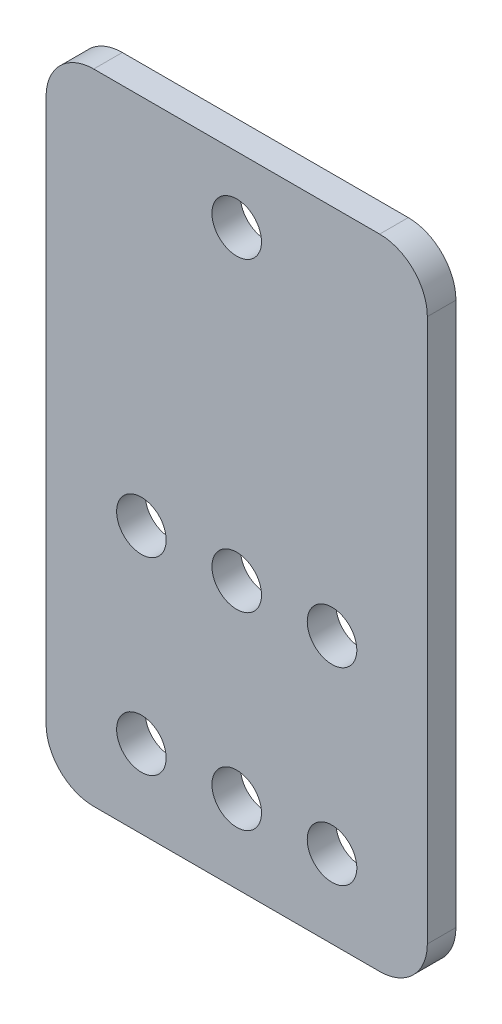
ISO-10303-21;
HEADER;
FILE_DESCRIPTION(('STEP AP214'),'2;1');
FILE_NAME('part.step','',(''),(''),'','','');
FILE_SCHEMA(('AUTOMOTIVE_DESIGN { 1 0 10303 214 1 1 1 1 }'));
ENDSEC;
DATA;
#1=APPLICATION_CONTEXT('core data for automotive mechanical design processes');
#2=APPLICATION_PROTOCOL_DEFINITION('international standard','automotive_design',2000,#1);
#3=PRODUCT_CONTEXT('',#1,'mechanical');
#4=PRODUCT('Part','Part','',(#3));
#5=PRODUCT_RELATED_PRODUCT_CATEGORY('part','',(#4));
#6=PRODUCT_DEFINITION_FORMATION('','',#4);
#7=PRODUCT_DEFINITION_CONTEXT('part definition',#1,'design');
#8=PRODUCT_DEFINITION('design','',#6,#7);
#9=PRODUCT_DEFINITION_SHAPE('','',#8);
#10=(LENGTH_UNIT() NAMED_UNIT(*) SI_UNIT(.MILLI.,.METRE.));
#11=(NAMED_UNIT(*) PLANE_ANGLE_UNIT() SI_UNIT($,.RADIAN.));
#12=(NAMED_UNIT(*) SI_UNIT($,.STERADIAN.) SOLID_ANGLE_UNIT());
#13=UNCERTAINTY_MEASURE_WITH_UNIT(LENGTH_MEASURE(1.E-05),#10,'distance_accuracy_value','');
#14=(GEOMETRIC_REPRESENTATION_CONTEXT(3) GLOBAL_UNCERTAINTY_ASSIGNED_CONTEXT((#13)) GLOBAL_UNIT_ASSIGNED_CONTEXT((#10,
#11,#12)) REPRESENTATION_CONTEXT('',''));
#15=CARTESIAN_POINT('',(0.,0.,0.));
#16=DIRECTION('',(0.,0.,1.));
#17=DIRECTION('',(1.,0.,0.));
#18=AXIS2_PLACEMENT_3D('',#15,#16,#17);
#19=CARTESIAN_POINT('',(-2.09664305646129,3.50955153260209,0.0876618779343517));
#20=DIRECTION('',(0.,0.,1.));
#21=DIRECTION('',(1.,0.,0.));
#22=AXIS2_PLACEMENT_3D('',#19,#20,#21);
#23=PLANE('',#22);
#24=CARTESIAN_POINT('',(-2.09664305646135,-1.99044846739791,0.0876618779343517));
#25=DIRECTION('',(0.,0.,1.));
#26=DIRECTION('',(1.,0.,0.));
#27=AXIS2_PLACEMENT_3D('',#24,#25,#26);
#28=CIRCLE('',#27,2.6);
#29=CARTESIAN_POINT('',(0.503356943538655,-1.99044846739791,0.0876618779343517));
#30=VERTEX_POINT('',#29);
#31=EDGE_CURVE('E189',#30,#30,#28,.T.);
#32=ORIENTED_EDGE('',*,*,#31,.F.);
#33=EDGE_LOOP('',(#32));
#34=FACE_BOUND('',#33,.T.);
#35=CARTESIAN_POINT('',(7.9033569435388,-21.7904484673979,0.0876618779343517));
#36=DIRECTION('',(0.,0.,1.));
#37=DIRECTION('',(-1.,0.,0.));
#38=AXIS2_PLACEMENT_3D('',#35,#36,#37);
#39=CIRCLE('',#38,2.59999999999999);
#40=CARTESIAN_POINT('',(5.30335694353881,-21.7904484673979,0.0876618779343517));
#41=VERTEX_POINT('',#40);
#42=EDGE_CURVE('E177',#41,#41,#39,.T.);
#43=ORIENTED_EDGE('',*,*,#42,.F.);
#44=EDGE_LOOP('',(#43));
#45=FACE_BOUND('',#44,.T.);
#46=CARTESIAN_POINT('',(-12.0966430564612,-21.7904484673979,0.0876618779343517));
#47=DIRECTION('',(0.,0.,1.));
#48=DIRECTION('',(1.,0.,0.));
#49=AXIS2_PLACEMENT_3D('',#46,#47,#48);
#50=CIRCLE('',#49,2.59999999999999);
#51=CARTESIAN_POINT('',(-9.49664305646121,-21.7904484673979,0.0876618779343517));
#52=VERTEX_POINT('',#51);
#53=EDGE_CURVE('E166',#52,#52,#50,.T.);
#54=ORIENTED_EDGE('',*,*,#53,.F.);
#55=EDGE_LOOP('',(#54));
#56=FACE_BOUND('',#55,.T.);
#57=DIRECTION('',(1.,0.,0.));
#58=VECTOR('',#57,1.);
#59=CARTESIAN_POINT('',(17.9033569435387,-29.990448467398,0.0876618779343517));
#60=LINE('',#59,#58);
#61=CARTESIAN_POINT('',(-17.0966430564613,-29.990448467398,0.0876618779343517));
#62=VERTEX_POINT('',#61);
#63=CARTESIAN_POINT('',(12.9033569435387,-29.990448467398,0.0876618779343517));
#64=VERTEX_POINT('',#63);
#65=EDGE_CURVE('E152',#62,#64,#60,.T.);
#66=ORIENTED_EDGE('',*,*,#65,.T.);
#67=CARTESIAN_POINT('',(12.9033569435387,-24.990448467398,0.0876618779343517));
#68=DIRECTION('',(0.,0.,1.));
#69=DIRECTION('',(1.,0.,0.));
#70=AXIS2_PLACEMENT_3D('',#67,#68,#69);
#71=CIRCLE('',#70,5.);
#72=CARTESIAN_POINT('',(17.9033569435387,-24.990448467398,0.0876618779343517));
#73=VERTEX_POINT('',#72);
#74=EDGE_CURVE('E130',#64,#73,#71,.T.);
#75=ORIENTED_EDGE('',*,*,#74,.T.);
#76=DIRECTION('',(0.,1.,0.));
#77=VECTOR('',#76,1.);
#78=CARTESIAN_POINT('',(17.9033569435387,-29.990448467398,0.0876618779343517));
#79=LINE('',#78,#77);
#80=CARTESIAN_POINT('',(17.9033569435387,32.009551532602,0.0876618779343517));
#81=VERTEX_POINT('',#80);
#82=EDGE_CURVE('E100',#73,#81,#79,.T.);
#83=ORIENTED_EDGE('',*,*,#82,.T.);
#84=CARTESIAN_POINT('',(12.9033569435387,32.009551532602,0.0876618779343517));
#85=DIRECTION('',(0.,0.,1.));
#86=DIRECTION('',(1.,0.,0.));
#87=AXIS2_PLACEMENT_3D('',#84,#85,#86);
#88=CIRCLE('',#87,5.);
#89=CARTESIAN_POINT('',(12.9033569435387,37.009551532602,0.0876618779343517));
#90=VERTEX_POINT('',#89);
#91=EDGE_CURVE('E36',#81,#90,#88,.T.);
#92=ORIENTED_EDGE('',*,*,#91,.T.);
#93=DIRECTION('',(-1.,0.,0.));
#94=VECTOR('',#93,1.);
#95=CARTESIAN_POINT('',(17.9033569435387,37.009551532602,0.0876618779343517));
#96=LINE('',#95,#94);
#97=CARTESIAN_POINT('',(-17.0966430564613,37.009551532602,0.0876618779343517));
#98=VERTEX_POINT('',#97);
#99=EDGE_CURVE('E116',#90,#98,#96,.T.);
#100=ORIENTED_EDGE('',*,*,#99,.T.);
#101=CARTESIAN_POINT('',(-17.0966430564613,32.009551532602,0.0876618779343517));
#102=DIRECTION('',(0.,0.,1.));
#103=DIRECTION('',(1.,0.,0.));
#104=AXIS2_PLACEMENT_3D('',#101,#102,#103);
#105=CIRCLE('',#104,5.);
#106=CARTESIAN_POINT('',(-22.0966430564613,32.009551532602,0.0876618779343517));
#107=VERTEX_POINT('',#106);
#108=EDGE_CURVE('E126',#98,#107,#105,.T.);
#109=ORIENTED_EDGE('',*,*,#108,.T.);
#110=DIRECTION('',(0.,-1.,0.));
#111=VECTOR('',#110,1.);
#112=CARTESIAN_POINT('',(-22.0966430564613,-29.990448467398,0.0876618779343517));
#113=LINE('',#112,#111);
#114=CARTESIAN_POINT('',(-22.0966430564613,-24.990448467398,0.0876618779343517));
#115=VERTEX_POINT('',#114);
#116=EDGE_CURVE('E110',#107,#115,#113,.T.);
#117=ORIENTED_EDGE('',*,*,#116,.T.);
#118=CARTESIAN_POINT('',(-17.0966430564613,-24.990448467398,0.0876618779343517));
#119=DIRECTION('',(0.,0.,1.));
#120=DIRECTION('',(1.,0.,0.));
#121=AXIS2_PLACEMENT_3D('',#118,#119,#120);
#122=CIRCLE('',#121,5.);
#123=EDGE_CURVE('E128',#115,#62,#122,.T.);
#124=ORIENTED_EDGE('',*,*,#123,.T.);
#125=EDGE_LOOP('',(#66,#75,#83,#92,#100,#109,#117,#124));
#126=FACE_BOUND('',#125,.T.);
#127=CARTESIAN_POINT('',(-2.09664305646129,30.109551532602,0.0876618779343517));
#128=DIRECTION('',(0.,0.,1.));
#129=DIRECTION('',(1.,0.,0.));
#130=AXIS2_PLACEMENT_3D('',#127,#128,#129);
#131=CIRCLE('',#130,2.6);
#132=CARTESIAN_POINT('',(0.503356943538712,30.109551532602,0.0876618779343517));
#133=VERTEX_POINT('',#132);
#134=EDGE_CURVE('E161',#133,#133,#131,.T.);
#135=ORIENTED_EDGE('',*,*,#134,.F.);
#136=EDGE_LOOP('',(#135));
#137=FACE_BOUND('',#136,.T.);
#138=CARTESIAN_POINT('',(-2.0966430564612,-21.7904484673979,0.0876618779343517));
#139=DIRECTION('',(0.,0.,1.));
#140=DIRECTION('',(1.,0.,0.));
#141=AXIS2_PLACEMENT_3D('',#138,#139,#140);
#142=CIRCLE('',#141,2.59999999999999);
#143=CARTESIAN_POINT('',(0.50335694353879,-21.7904484673979,0.0876618779343517));
#144=VERTEX_POINT('',#143);
#145=EDGE_CURVE('E171',#144,#144,#142,.T.);
#146=ORIENTED_EDGE('',*,*,#145,.F.);
#147=EDGE_LOOP('',(#146));
#148=FACE_BOUND('',#147,.T.);
#149=CARTESIAN_POINT('',(-12.0966430564613,-1.99044846739791,0.0876618779343517));
#150=DIRECTION('',(0.,0.,1.));
#151=DIRECTION('',(1.,0.,0.));
#152=AXIS2_PLACEMENT_3D('',#149,#150,#151);
#153=CIRCLE('',#152,2.6);
#154=CARTESIAN_POINT('',(-9.49664305646127,-1.99044846739791,0.0876618779343517));
#155=VERTEX_POINT('',#154);
#156=EDGE_CURVE('E183',#155,#155,#153,.T.);
#157=ORIENTED_EDGE('',*,*,#156,.F.);
#158=EDGE_LOOP('',(#157));
#159=FACE_BOUND('',#158,.T.);
#160=CARTESIAN_POINT('',(7.90335694353873,-1.99044846739785,0.0876618779343517));
#161=DIRECTION('',(0.,0.,1.));
#162=DIRECTION('',(-1.,0.,0.));
#163=AXIS2_PLACEMENT_3D('',#160,#161,#162);
#164=CIRCLE('',#163,2.59999999999999);
#165=CARTESIAN_POINT('',(5.30335694353874,-1.99044846739785,0.0876618779343517));
#166=VERTEX_POINT('',#165);
#167=EDGE_CURVE('E195',#166,#166,#164,.T.);
#168=ORIENTED_EDGE('',*,*,#167,.F.);
#169=EDGE_LOOP('',(#168));
#170=FACE_BOUND('',#169,.T.);
#171=ADVANCED_FACE('F16',(#34,#45,#56,#126,#137,#148,#159,#170),#23,.T.);
#172=CARTESIAN_POINT('',(-2.09664305646129,3.50955153260209,-2.91233812206565));
#173=DIRECTION('',(0.,0.,1.));
#174=DIRECTION('',(1.,0.,0.));
#175=AXIS2_PLACEMENT_3D('',#172,#173,#174);
#176=PLANE('',#175);
#177=DIRECTION('',(0.,1.,0.));
#178=VECTOR('',#177,1.);
#179=CARTESIAN_POINT('',(17.9033569435387,-29.990448467398,-2.91233812206565));
#180=LINE('',#179,#178);
#181=CARTESIAN_POINT('',(17.9033569435387,-24.990448467398,-2.91233812206565));
#182=VERTEX_POINT('',#181);
#183=CARTESIAN_POINT('',(17.9033569435387,32.009551532602,-2.91233812206565));
#184=VERTEX_POINT('',#183);
#185=EDGE_CURVE('E98',#182,#184,#180,.T.);
#186=ORIENTED_EDGE('',*,*,#185,.F.);
#187=CARTESIAN_POINT('',(12.9033569435387,-24.990448467398,-2.91233812206565));
#188=DIRECTION('',(0.,0.,1.));
#189=DIRECTION('',(1.,0.,0.));
#190=AXIS2_PLACEMENT_3D('',#187,#188,#189);
#191=CIRCLE('',#190,5.);
#192=CARTESIAN_POINT('',(12.9033569435387,-29.990448467398,-2.91233812206565));
#193=VERTEX_POINT('',#192);
#194=EDGE_CURVE('E81',#182,#193,#191,.F.);
#195=ORIENTED_EDGE('',*,*,#194,.T.);
#196=DIRECTION('',(1.,0.,0.));
#197=VECTOR('',#196,1.);
#198=CARTESIAN_POINT('',(17.9033569435387,-29.990448467398,-2.91233812206565));
#199=LINE('',#198,#197);
#200=CARTESIAN_POINT('',(-17.0966430564613,-29.990448467398,-2.91233812206565));
#201=VERTEX_POINT('',#200);
#202=EDGE_CURVE('E108',#201,#193,#199,.T.);
#203=ORIENTED_EDGE('',*,*,#202,.F.);
#204=CARTESIAN_POINT('',(-17.0966430564613,-24.990448467398,-2.91233812206565));
#205=DIRECTION('',(0.,0.,1.));
#206=DIRECTION('',(1.,0.,0.));
#207=AXIS2_PLACEMENT_3D('',#204,#205,#206);
#208=CIRCLE('',#207,5.);
#209=CARTESIAN_POINT('',(-22.0966430564613,-24.990448467398,-2.91233812206565));
#210=VERTEX_POINT('',#209);
#211=EDGE_CURVE('E92',#201,#210,#208,.F.);
#212=ORIENTED_EDGE('',*,*,#211,.T.);
#213=DIRECTION('',(0.,-1.,0.));
#214=VECTOR('',#213,1.);
#215=CARTESIAN_POINT('',(-22.0966430564613,-29.990448467398,-2.91233812206565));
#216=LINE('',#215,#214);
#217=CARTESIAN_POINT('',(-22.0966430564613,32.009551532602,-2.91233812206565));
#218=VERTEX_POINT('',#217);
#219=EDGE_CURVE('E112',#218,#210,#216,.T.);
#220=ORIENTED_EDGE('',*,*,#219,.F.);
#221=CARTESIAN_POINT('',(-17.0966430564613,32.009551532602,-2.91233812206565));
#222=DIRECTION('',(0.,0.,1.));
#223=DIRECTION('',(1.,0.,0.));
#224=AXIS2_PLACEMENT_3D('',#221,#222,#223);
#225=CIRCLE('',#224,5.);
#226=CARTESIAN_POINT('',(-17.0966430564613,37.009551532602,-2.91233812206565));
#227=VERTEX_POINT('',#226);
#228=EDGE_CURVE('E119',#218,#227,#225,.F.);
#229=ORIENTED_EDGE('',*,*,#228,.T.);
#230=DIRECTION('',(-1.,0.,0.));
#231=VECTOR('',#230,1.);
#232=CARTESIAN_POINT('',(17.9033569435387,37.009551532602,-2.91233812206565));
#233=LINE('',#232,#231);
#234=CARTESIAN_POINT('',(12.9033569435387,37.009551532602,-2.91233812206565));
#235=VERTEX_POINT('',#234);
#236=EDGE_CURVE('E107',#235,#227,#233,.T.);
#237=ORIENTED_EDGE('',*,*,#236,.F.);
#238=CARTESIAN_POINT('',(12.9033569435387,32.009551532602,-2.91233812206565));
#239=DIRECTION('',(0.,0.,1.));
#240=DIRECTION('',(1.,0.,0.));
#241=AXIS2_PLACEMENT_3D('',#238,#239,#240);
#242=CIRCLE('',#241,5.);
#243=EDGE_CURVE('E101',#235,#184,#242,.F.);
#244=ORIENTED_EDGE('',*,*,#243,.T.);
#245=EDGE_LOOP('',(#186,#195,#203,#212,#220,#229,#237,#244));
#246=FACE_BOUND('',#245,.T.);
#247=CARTESIAN_POINT('',(-2.09664305646129,30.109551532602,-2.91233812206565));
#248=DIRECTION('',(0.,0.,1.));
#249=DIRECTION('',(1.,0.,0.));
#250=AXIS2_PLACEMENT_3D('',#247,#248,#249);
#251=CIRCLE('',#250,2.6);
#252=CARTESIAN_POINT('',(0.503356943538712,30.109551532602,-2.91233812206565));
#253=VERTEX_POINT('',#252);
#254=EDGE_CURVE('E157',#253,#253,#251,.T.);
#255=ORIENTED_EDGE('',*,*,#254,.T.);
#256=EDGE_LOOP('',(#255));
#257=FACE_BOUND('',#256,.T.);
#258=CARTESIAN_POINT('',(-12.0966430564612,-21.7904484673979,-2.91233812206565));
#259=DIRECTION('',(0.,0.,1.));
#260=DIRECTION('',(1.,0.,0.));
#261=AXIS2_PLACEMENT_3D('',#258,#259,#260);
#262=CIRCLE('',#261,2.59999999999999);
#263=CARTESIAN_POINT('',(-9.49664305646121,-21.7904484673979,-2.91233812206565));
#264=VERTEX_POINT('',#263);
#265=EDGE_CURVE('E168',#264,#264,#262,.T.);
#266=ORIENTED_EDGE('',*,*,#265,.T.);
#267=EDGE_LOOP('',(#266));
#268=FACE_BOUND('',#267,.T.);
#269=CARTESIAN_POINT('',(-2.0966430564612,-21.7904484673979,-2.91233812206565));
#270=DIRECTION('',(0.,0.,1.));
#271=DIRECTION('',(1.,0.,0.));
#272=AXIS2_PLACEMENT_3D('',#269,#270,#271);
#273=CIRCLE('',#272,2.59999999999999);
#274=CARTESIAN_POINT('',(0.50335694353879,-21.7904484673979,-2.91233812206565));
#275=VERTEX_POINT('',#274);
#276=EDGE_CURVE('E174',#275,#275,#273,.T.);
#277=ORIENTED_EDGE('',*,*,#276,.T.);
#278=EDGE_LOOP('',(#277));
#279=FACE_BOUND('',#278,.T.);
#280=CARTESIAN_POINT('',(7.9033569435388,-21.7904484673979,-2.91233812206565));
#281=DIRECTION('',(0.,0.,1.));
#282=DIRECTION('',(-1.,0.,0.));
#283=AXIS2_PLACEMENT_3D('',#280,#281,#282);
#284=CIRCLE('',#283,2.59999999999999);
#285=CARTESIAN_POINT('',(5.30335694353881,-21.7904484673979,-2.91233812206565));
#286=VERTEX_POINT('',#285);
#287=EDGE_CURVE('E180',#286,#286,#284,.T.);
#288=ORIENTED_EDGE('',*,*,#287,.T.);
#289=EDGE_LOOP('',(#288));
#290=FACE_BOUND('',#289,.T.);
#291=CARTESIAN_POINT('',(-12.0966430564613,-1.99044846739791,-2.91233812206565));
#292=DIRECTION('',(0.,0.,1.));
#293=DIRECTION('',(1.,0.,0.));
#294=AXIS2_PLACEMENT_3D('',#291,#292,#293);
#295=CIRCLE('',#294,2.6);
#296=CARTESIAN_POINT('',(-9.49664305646127,-1.99044846739791,-2.91233812206565));
#297=VERTEX_POINT('',#296);
#298=EDGE_CURVE('E186',#297,#297,#295,.T.);
#299=ORIENTED_EDGE('',*,*,#298,.T.);
#300=EDGE_LOOP('',(#299));
#301=FACE_BOUND('',#300,.T.);
#302=CARTESIAN_POINT('',(-2.09664305646135,-1.99044846739791,-2.91233812206565));
#303=DIRECTION('',(0.,0.,1.));
#304=DIRECTION('',(1.,0.,0.));
#305=AXIS2_PLACEMENT_3D('',#302,#303,#304);
#306=CIRCLE('',#305,2.6);
#307=CARTESIAN_POINT('',(0.503356943538655,-1.99044846739791,-2.91233812206565));
#308=VERTEX_POINT('',#307);
#309=EDGE_CURVE('E192',#308,#308,#306,.T.);
#310=ORIENTED_EDGE('',*,*,#309,.T.);
#311=EDGE_LOOP('',(#310));
#312=FACE_BOUND('',#311,.T.);
#313=CARTESIAN_POINT('',(7.90335694353873,-1.99044846739785,-2.91233812206565));
#314=DIRECTION('',(0.,0.,1.));
#315=DIRECTION('',(-1.,0.,0.));
#316=AXIS2_PLACEMENT_3D('',#313,#314,#315);
#317=CIRCLE('',#316,2.59999999999999);
#318=CARTESIAN_POINT('',(5.30335694353874,-1.99044846739785,-2.91233812206565));
#319=VERTEX_POINT('',#318);
#320=EDGE_CURVE('E198',#319,#319,#317,.T.);
#321=ORIENTED_EDGE('',*,*,#320,.T.);
#322=EDGE_LOOP('',(#321));
#323=FACE_BOUND('',#322,.T.);
#324=ADVANCED_FACE('F104',(#246,#257,#268,#279,#290,#301,#312,#323),#176,.F.);
#325=CARTESIAN_POINT('',(-22.0966430564613,-29.990448467398,0.0876618779343517));
#326=DIRECTION('',(1.,0.,0.));
#327=DIRECTION('',(0.,1.,0.));
#328=AXIS2_PLACEMENT_3D('',#325,#326,#327);
#329=PLANE('',#328);
#330=ORIENTED_EDGE('',*,*,#219,.T.);
#331=DIRECTION('',(0.,0.,-1.));
#332=VECTOR('',#331,1.);
#333=CARTESIAN_POINT('',(-22.0966430564613,-24.990448467398,0.0876618779343517));
#334=LINE('',#333,#332);
#335=EDGE_CURVE('E135',#210,#115,#334,.F.);
#336=ORIENTED_EDGE('',*,*,#335,.T.);
#337=ORIENTED_EDGE('',*,*,#116,.F.);
#338=DIRECTION('',(0.,0.,-1.));
#339=VECTOR('',#338,1.);
#340=CARTESIAN_POINT('',(-22.0966430564613,32.009551532602,0.0876618779343517));
#341=LINE('',#340,#339);
#342=EDGE_CURVE('E132',#107,#218,#341,.T.);
#343=ORIENTED_EDGE('',*,*,#342,.T.);
#344=EDGE_LOOP('',(#330,#336,#337,#343));
#345=FACE_BOUND('',#344,.T.);
#346=ADVANCED_FACE('F148',(#345),#329,.F.);
#347=CARTESIAN_POINT('',(17.9033569435387,-29.990448467398,0.0876618779343517));
#348=DIRECTION('',(0.,1.,0.));
#349=DIRECTION('',(-1.,0.,0.));
#350=AXIS2_PLACEMENT_3D('',#347,#348,#349);
#351=PLANE('',#350);
#352=ORIENTED_EDGE('',*,*,#202,.T.);
#353=DIRECTION('',(0.,0.,-1.));
#354=VECTOR('',#353,1.);
#355=CARTESIAN_POINT('',(12.9033569435387,-29.990448467398,0.0876618779343517));
#356=LINE('',#355,#354);
#357=EDGE_CURVE('E86',#193,#64,#356,.F.);
#358=ORIENTED_EDGE('',*,*,#357,.T.);
#359=ORIENTED_EDGE('',*,*,#65,.F.);
#360=DIRECTION('',(0.,0.,-1.));
#361=VECTOR('',#360,1.);
#362=CARTESIAN_POINT('',(-17.0966430564613,-29.990448467398,0.0876618779343517));
#363=LINE('',#362,#361);
#364=EDGE_CURVE('E91',#62,#201,#363,.T.);
#365=ORIENTED_EDGE('',*,*,#364,.T.);
#366=EDGE_LOOP('',(#352,#358,#359,#365));
#367=FACE_BOUND('',#366,.T.);
#368=ADVANCED_FACE('F225',(#367),#351,.F.);
#369=CARTESIAN_POINT('',(17.9033569435387,-29.990448467398,0.0876618779343517));
#370=DIRECTION('',(-1.,0.,0.));
#371=DIRECTION('',(0.,-1.,0.));
#372=AXIS2_PLACEMENT_3D('',#369,#370,#371);
#373=PLANE('',#372);
#374=ORIENTED_EDGE('',*,*,#82,.F.);
#375=DIRECTION('',(0.,0.,-1.));
#376=VECTOR('',#375,1.);
#377=CARTESIAN_POINT('',(17.9033569435387,-24.990448467398,0.0876618779343517));
#378=LINE('',#377,#376);
#379=EDGE_CURVE('E85',#73,#182,#378,.T.);
#380=ORIENTED_EDGE('',*,*,#379,.T.);
#381=ORIENTED_EDGE('',*,*,#185,.T.);
#382=DIRECTION('',(0.,0.,-1.));
#383=VECTOR('',#382,1.);
#384=CARTESIAN_POINT('',(17.9033569435387,32.009551532602,0.0876618779343517));
#385=LINE('',#384,#383);
#386=EDGE_CURVE('E102',#184,#81,#385,.F.);
#387=ORIENTED_EDGE('',*,*,#386,.T.);
#388=EDGE_LOOP('',(#374,#380,#381,#387));
#389=FACE_BOUND('',#388,.T.);
#390=ADVANCED_FACE('F97',(#389),#373,.F.);
#391=CARTESIAN_POINT('',(17.9033569435387,37.009551532602,0.0876618779343517));
#392=DIRECTION('',(0.,-1.,0.));
#393=DIRECTION('',(1.,0.,0.));
#394=AXIS2_PLACEMENT_3D('',#391,#392,#393);
#395=PLANE('',#394);
#396=ORIENTED_EDGE('',*,*,#236,.T.);
#397=DIRECTION('',(0.,0.,-1.));
#398=VECTOR('',#397,1.);
#399=CARTESIAN_POINT('',(-17.0966430564613,37.009551532602,0.0876618779343517));
#400=LINE('',#399,#398);
#401=EDGE_CURVE('E10',#227,#98,#400,.F.);
#402=ORIENTED_EDGE('',*,*,#401,.T.);
#403=ORIENTED_EDGE('',*,*,#99,.F.);
#404=DIRECTION('',(0.,0.,-1.));
#405=VECTOR('',#404,1.);
#406=CARTESIAN_POINT('',(12.9033569435387,37.009551532602,0.0876618779343517));
#407=LINE('',#406,#405);
#408=EDGE_CURVE('E24',#90,#235,#407,.T.);
#409=ORIENTED_EDGE('',*,*,#408,.T.);
#410=EDGE_LOOP('',(#396,#402,#403,#409));
#411=FACE_BOUND('',#410,.T.);
#412=ADVANCED_FACE('F138',(#411),#395,.F.);
#413=CARTESIAN_POINT('',(-2.09664305646129,30.109551532602,0.0876618779343517));
#414=DIRECTION('',(0.,0.,-1.));
#415=DIRECTION('',(-1.,0.,0.));
#416=AXIS2_PLACEMENT_3D('',#413,#414,#415);
#417=CYLINDRICAL_SURFACE('',#416,2.6);
#418=ORIENTED_EDGE('',*,*,#134,.T.);
#419=EDGE_LOOP('',(#418));
#420=FACE_BOUND('',#419,.T.);
#421=ORIENTED_EDGE('',*,*,#254,.F.);
#422=EDGE_LOOP('',(#421));
#423=FACE_BOUND('',#422,.T.);
#424=ADVANCED_FACE('F218',(#420,#423),#417,.F.);
#425=CARTESIAN_POINT('',(-12.0966430564612,-21.7904484673979,0.0876618779343517));
#426=DIRECTION('',(0.,0.,-1.));
#427=DIRECTION('',(-1.,0.,0.));
#428=AXIS2_PLACEMENT_3D('',#425,#426,#427);
#429=CYLINDRICAL_SURFACE('',#428,2.59999999999999);
#430=ORIENTED_EDGE('',*,*,#53,.T.);
#431=EDGE_LOOP('',(#430));
#432=FACE_BOUND('',#431,.T.);
#433=ORIENTED_EDGE('',*,*,#265,.F.);
#434=EDGE_LOOP('',(#433));
#435=FACE_BOUND('',#434,.T.);
#436=ADVANCED_FACE('F275',(#432,#435),#429,.F.);
#437=CARTESIAN_POINT('',(-2.0966430564612,-21.7904484673979,0.0876618779343517));
#438=DIRECTION('',(0.,0.,-1.));
#439=DIRECTION('',(-1.,0.,0.));
#440=AXIS2_PLACEMENT_3D('',#437,#438,#439);
#441=CYLINDRICAL_SURFACE('',#440,2.59999999999999);
#442=ORIENTED_EDGE('',*,*,#145,.T.);
#443=EDGE_LOOP('',(#442));
#444=FACE_BOUND('',#443,.T.);
#445=ORIENTED_EDGE('',*,*,#276,.F.);
#446=EDGE_LOOP('',(#445));
#447=FACE_BOUND('',#446,.T.);
#448=ADVANCED_FACE('F272',(#444,#447),#441,.F.);
#449=CARTESIAN_POINT('',(7.9033569435388,-21.7904484673979,0.0876618779343517));
#450=DIRECTION('',(0.,0.,-1.));
#451=DIRECTION('',(-1.,0.,0.));
#452=AXIS2_PLACEMENT_3D('',#449,#450,#451);
#453=CYLINDRICAL_SURFACE('',#452,2.59999999999999);
#454=ORIENTED_EDGE('',*,*,#42,.T.);
#455=EDGE_LOOP('',(#454));
#456=FACE_BOUND('',#455,.T.);
#457=ORIENTED_EDGE('',*,*,#287,.F.);
#458=EDGE_LOOP('',(#457));
#459=FACE_BOUND('',#458,.T.);
#460=ADVANCED_FACE('F254',(#456,#459),#453,.F.);
#461=CARTESIAN_POINT('',(-12.0966430564613,-1.99044846739791,0.0876618779343517));
#462=DIRECTION('',(0.,0.,-1.));
#463=DIRECTION('',(-1.,0.,0.));
#464=AXIS2_PLACEMENT_3D('',#461,#462,#463);
#465=CYLINDRICAL_SURFACE('',#464,2.6);
#466=ORIENTED_EDGE('',*,*,#156,.T.);
#467=EDGE_LOOP('',(#466));
#468=FACE_BOUND('',#467,.T.);
#469=ORIENTED_EDGE('',*,*,#298,.F.);
#470=EDGE_LOOP('',(#469));
#471=FACE_BOUND('',#470,.T.);
#472=ADVANCED_FACE('F250',(#468,#471),#465,.F.);
#473=CARTESIAN_POINT('',(-2.09664305646135,-1.99044846739791,0.0876618779343517));
#474=DIRECTION('',(0.,0.,-1.));
#475=DIRECTION('',(-1.,0.,0.));
#476=AXIS2_PLACEMENT_3D('',#473,#474,#475);
#477=CYLINDRICAL_SURFACE('',#476,2.6);
#478=ORIENTED_EDGE('',*,*,#31,.T.);
#479=EDGE_LOOP('',(#478));
#480=FACE_BOUND('',#479,.T.);
#481=ORIENTED_EDGE('',*,*,#309,.F.);
#482=EDGE_LOOP('',(#481));
#483=FACE_BOUND('',#482,.T.);
#484=ADVANCED_FACE('F253',(#480,#483),#477,.F.);
#485=CARTESIAN_POINT('',(7.90335694353873,-1.99044846739785,0.0876618779343517));
#486=DIRECTION('',(0.,0.,-1.));
#487=DIRECTION('',(-1.,0.,0.));
#488=AXIS2_PLACEMENT_3D('',#485,#486,#487);
#489=CYLINDRICAL_SURFACE('',#488,2.59999999999999);
#490=ORIENTED_EDGE('',*,*,#167,.T.);
#491=EDGE_LOOP('',(#490));
#492=FACE_BOUND('',#491,.T.);
#493=ORIENTED_EDGE('',*,*,#320,.F.);
#494=EDGE_LOOP('',(#493));
#495=FACE_BOUND('',#494,.T.);
#496=ADVANCED_FACE('F204',(#492,#495),#489,.F.);
#497=CARTESIAN_POINT('',(12.9033569435387,-24.990448467398,0.0876618779343517));
#498=DIRECTION('',(0.,0.,-1.));
#499=DIRECTION('',(-1.,0.,0.));
#500=AXIS2_PLACEMENT_3D('',#497,#498,#499);
#501=CYLINDRICAL_SURFACE('',#500,5.);
#502=ORIENTED_EDGE('',*,*,#74,.F.);
#503=ORIENTED_EDGE('',*,*,#357,.F.);
#504=ORIENTED_EDGE('',*,*,#194,.F.);
#505=ORIENTED_EDGE('',*,*,#379,.F.);
#506=EDGE_LOOP('',(#502,#503,#504,#505));
#507=FACE_BOUND('',#506,.T.);
#508=ADVANCED_FACE('F84',(#507),#501,.T.);
#509=CARTESIAN_POINT('',(-17.0966430564613,-24.990448467398,0.0876618779343517));
#510=DIRECTION('',(0.,0.,-1.));
#511=DIRECTION('',(-1.,0.,0.));
#512=AXIS2_PLACEMENT_3D('',#509,#510,#511);
#513=CYLINDRICAL_SURFACE('',#512,5.);
#514=ORIENTED_EDGE('',*,*,#123,.F.);
#515=ORIENTED_EDGE('',*,*,#335,.F.);
#516=ORIENTED_EDGE('',*,*,#211,.F.);
#517=ORIENTED_EDGE('',*,*,#364,.F.);
#518=EDGE_LOOP('',(#514,#515,#516,#517));
#519=FACE_BOUND('',#518,.T.);
#520=ADVANCED_FACE('F233',(#519),#513,.T.);
#521=CARTESIAN_POINT('',(-17.0966430564613,32.009551532602,0.0876618779343517));
#522=DIRECTION('',(0.,0.,-1.));
#523=DIRECTION('',(-1.,0.,0.));
#524=AXIS2_PLACEMENT_3D('',#521,#522,#523);
#525=CYLINDRICAL_SURFACE('',#524,5.);
#526=ORIENTED_EDGE('',*,*,#108,.F.);
#527=ORIENTED_EDGE('',*,*,#401,.F.);
#528=ORIENTED_EDGE('',*,*,#228,.F.);
#529=ORIENTED_EDGE('',*,*,#342,.F.);
#530=EDGE_LOOP('',(#526,#527,#528,#529));
#531=FACE_BOUND('',#530,.T.);
#532=ADVANCED_FACE('F145',(#531),#525,.T.);
#533=CARTESIAN_POINT('',(12.9033569435387,32.009551532602,0.0876618779343517));
#534=DIRECTION('',(0.,0.,-1.));
#535=DIRECTION('',(-1.,0.,0.));
#536=AXIS2_PLACEMENT_3D('',#533,#534,#535);
#537=CYLINDRICAL_SURFACE('',#536,5.);
#538=ORIENTED_EDGE('',*,*,#91,.F.);
#539=ORIENTED_EDGE('',*,*,#386,.F.);
#540=ORIENTED_EDGE('',*,*,#243,.F.);
#541=ORIENTED_EDGE('',*,*,#408,.F.);
#542=EDGE_LOOP('',(#538,#539,#540,#541));
#543=FACE_BOUND('',#542,.T.);
#544=ADVANCED_FACE('F18',(#543),#537,.T.);
#545=CLOSED_SHELL('',(#171,#324,#346,#368,#390,#412,#424,#436,#448,#460,#472,#484,#496,#508,
#520,#532,#544));
#546=MANIFOLD_SOLID_BREP('B1',#545);
#547=ADVANCED_BREP_SHAPE_REPRESENTATION('',(#18,#546),#14);
#548=SHAPE_DEFINITION_REPRESENTATION(#9,#547);
ENDSEC;
END-ISO-10303-21;
